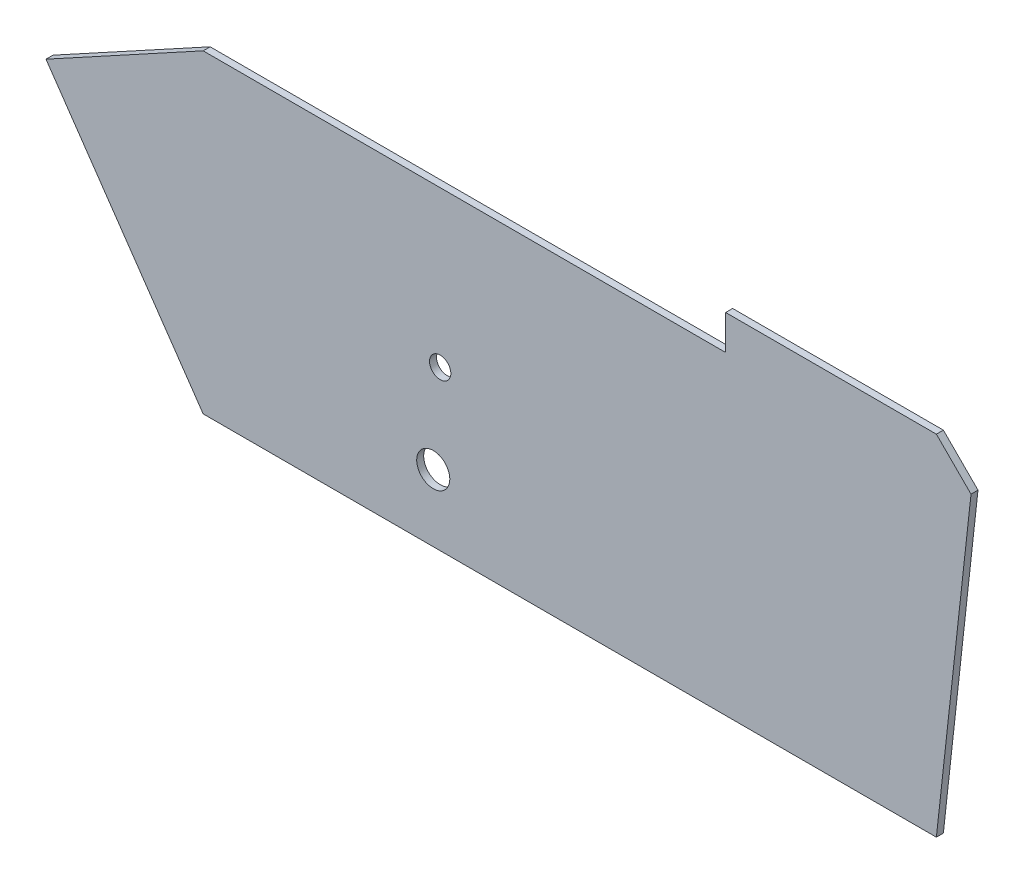
ISO-10303-21;
HEADER;
FILE_DESCRIPTION(('STEP AP214'),'2;1');
FILE_NAME('part.step','',(''),(''),'','','');
FILE_SCHEMA(('AUTOMOTIVE_DESIGN { 1 0 10303 214 1 1 1 1 }'));
ENDSEC;
DATA;
#1=APPLICATION_CONTEXT('core data for automotive mechanical design processes');
#2=APPLICATION_PROTOCOL_DEFINITION('international standard','automotive_design',2000,#1);
#3=PRODUCT_CONTEXT('',#1,'mechanical');
#4=PRODUCT('Part','Part','',(#3));
#5=PRODUCT_RELATED_PRODUCT_CATEGORY('part','',(#4));
#6=PRODUCT_DEFINITION_FORMATION('','',#4);
#7=PRODUCT_DEFINITION_CONTEXT('part definition',#1,'design');
#8=PRODUCT_DEFINITION('design','',#6,#7);
#9=PRODUCT_DEFINITION_SHAPE('','',#8);
#10=(LENGTH_UNIT() NAMED_UNIT(*) SI_UNIT(.MILLI.,.METRE.));
#11=(NAMED_UNIT(*) PLANE_ANGLE_UNIT() SI_UNIT($,.RADIAN.));
#12=(NAMED_UNIT(*) SI_UNIT($,.STERADIAN.) SOLID_ANGLE_UNIT());
#13=UNCERTAINTY_MEASURE_WITH_UNIT(LENGTH_MEASURE(1.E-05),#10,'distance_accuracy_value','');
#14=(GEOMETRIC_REPRESENTATION_CONTEXT(3) GLOBAL_UNCERTAINTY_ASSIGNED_CONTEXT((#13)) GLOBAL_UNIT_ASSIGNED_CONTEXT((#10,
#11,#12)) REPRESENTATION_CONTEXT('',''));
#15=CARTESIAN_POINT('',(0.,0.,0.));
#16=DIRECTION('',(0.,0.,1.));
#17=DIRECTION('',(1.,0.,0.));
#18=AXIS2_PLACEMENT_3D('',#15,#16,#17);
#19=CARTESIAN_POINT('',(131.671208139632,88.9838337182448,2.));
#20=DIRECTION('',(0.,-1.,0.));
#21=DIRECTION('',(0.,0.,-1.));
#22=AXIS2_PLACEMENT_3D('',#19,#20,#21);
#23=PLANE('',#22);
#24=DIRECTION('',(-1.,0.,0.));
#25=VECTOR('',#24,1.);
#26=CARTESIAN_POINT('',(131.671208139632,88.9838337182448,0.));
#27=LINE('',#26,#25);
#28=CARTESIAN_POINT('',(192.039285274391,88.9838337182448,0.));
#29=VERTEX_POINT('',#28);
#30=CARTESIAN_POINT('',(131.671208139632,88.9838337182448,0.));
#31=VERTEX_POINT('',#30);
#32=EDGE_CURVE('E147',#29,#31,#27,.T.);
#33=ORIENTED_EDGE('',*,*,#32,.T.);
#34=DIRECTION('',(0.,0.,-1.));
#35=VECTOR('',#34,1.);
#36=CARTESIAN_POINT('',(131.671208139632,88.9838337182448,2.));
#37=LINE('',#36,#35);
#38=CARTESIAN_POINT('',(131.671208139632,88.9838337182448,2.));
#39=VERTEX_POINT('',#38);
#40=EDGE_CURVE('E11',#39,#31,#37,.T.);
#41=ORIENTED_EDGE('',*,*,#40,.F.);
#42=DIRECTION('',(-1.,0.,0.));
#43=VECTOR('',#42,1.);
#44=CARTESIAN_POINT('',(131.671208139632,88.9838337182448,2.));
#45=LINE('',#44,#43);
#46=CARTESIAN_POINT('',(192.039285274391,88.9838337182448,2.));
#47=VERTEX_POINT('',#46);
#48=EDGE_CURVE('E168',#47,#39,#45,.T.);
#49=ORIENTED_EDGE('',*,*,#48,.F.);
#50=DIRECTION('',(0.,0.,-1.));
#51=VECTOR('',#50,1.);
#52=CARTESIAN_POINT('',(192.039285274391,88.9838337182448,2.));
#53=LINE('',#52,#51);
#54=EDGE_CURVE('E143',#47,#29,#53,.T.);
#55=ORIENTED_EDGE('',*,*,#54,.T.);
#56=EDGE_LOOP('',(#33,#41,#49,#55));
#57=FACE_BOUND('',#56,.T.);
#58=ADVANCED_FACE('F42',(#57),#23,.F.);
#59=CARTESIAN_POINT('',(131.671208139632,79.0600704937911,2.));
#60=DIRECTION('',(1.,0.,0.));
#61=DIRECTION('',(0.,1.,0.));
#62=AXIS2_PLACEMENT_3D('',#59,#60,#61);
#63=PLANE('',#62);
#64=DIRECTION('',(0.,-1.,0.));
#65=VECTOR('',#64,1.);
#66=CARTESIAN_POINT('',(131.671208139632,79.0600704937911,0.));
#67=LINE('',#66,#65);
#68=CARTESIAN_POINT('',(131.671208139632,79.0600704937911,0.));
#69=VERTEX_POINT('',#68);
#70=EDGE_CURVE('E151',#31,#69,#67,.T.);
#71=ORIENTED_EDGE('',*,*,#70,.T.);
#72=DIRECTION('',(0.,0.,-1.));
#73=VECTOR('',#72,1.);
#74=CARTESIAN_POINT('',(131.671208139632,79.0600704937911,2.));
#75=LINE('',#74,#73);
#76=CARTESIAN_POINT('',(131.671208139632,79.0600704937911,2.));
#77=VERTEX_POINT('',#76);
#78=EDGE_CURVE('E52',#77,#69,#75,.T.);
#79=ORIENTED_EDGE('',*,*,#78,.F.);
#80=DIRECTION('',(0.,-1.,0.));
#81=VECTOR('',#80,1.);
#82=CARTESIAN_POINT('',(131.671208139632,79.0600704937911,2.));
#83=LINE('',#82,#81);
#84=EDGE_CURVE('E104',#39,#77,#83,.T.);
#85=ORIENTED_EDGE('',*,*,#84,.F.);
#86=ORIENTED_EDGE('',*,*,#40,.T.);
#87=EDGE_LOOP('',(#71,#79,#85,#86));
#88=FACE_BOUND('',#87,.T.);
#89=ADVANCED_FACE('F241',(#88),#63,.F.);
#90=CARTESIAN_POINT('',(-18.0080374773618,79.0600704937911,2.));
#91=DIRECTION('',(0.,-1.,0.));
#92=DIRECTION('',(0.,0.,-1.));
#93=AXIS2_PLACEMENT_3D('',#90,#91,#92);
#94=PLANE('',#93);
#95=DIRECTION('',(-1.,0.,0.));
#96=VECTOR('',#95,1.);
#97=CARTESIAN_POINT('',(-18.0080374773618,79.0600704937911,0.));
#98=LINE('',#97,#96);
#99=CARTESIAN_POINT('',(-18.0080374773618,79.0600704937911,0.));
#100=VERTEX_POINT('',#99);
#101=EDGE_CURVE('E154',#69,#100,#98,.T.);
#102=ORIENTED_EDGE('',*,*,#101,.T.);
#103=DIRECTION('',(0.,0.,-1.));
#104=VECTOR('',#103,1.);
#105=CARTESIAN_POINT('',(-18.0080374773618,79.0600704937911,2.));
#106=LINE('',#105,#104);
#107=CARTESIAN_POINT('',(-18.0080374773618,79.0600704937911,2.));
#108=VERTEX_POINT('',#107);
#109=EDGE_CURVE('E179',#108,#100,#106,.T.);
#110=ORIENTED_EDGE('',*,*,#109,.F.);
#111=DIRECTION('',(-1.,0.,0.));
#112=VECTOR('',#111,1.);
#113=CARTESIAN_POINT('',(-18.0080374773618,79.0600704937911,2.));
#114=LINE('',#113,#112);
#115=EDGE_CURVE('E206',#77,#108,#114,.T.);
#116=ORIENTED_EDGE('',*,*,#115,.F.);
#117=ORIENTED_EDGE('',*,*,#78,.T.);
#118=EDGE_LOOP('',(#102,#110,#116,#117));
#119=FACE_BOUND('',#118,.T.);
#120=ADVANCED_FACE('F245',(#119),#94,.F.);
#121=CARTESIAN_POINT('',(-18.0080374773618,79.0600704937911,2.));
#122=DIRECTION('',(0.479246327767747,-0.877680441459834,0.));
#123=DIRECTION('',(0.877680441459834,0.479246327767746,0.));
#124=AXIS2_PLACEMENT_3D('',#121,#122,#123);
#125=PLANE('',#124);
#126=DIRECTION('',(-0.877680441459834,-0.479246327767747,0.));
#127=VECTOR('',#126,1.);
#128=CARTESIAN_POINT('',(-18.0080374773618,79.0600704937911,0.));
#129=LINE('',#128,#127);
#130=CARTESIAN_POINT('',(-63.0369515011548,54.4726003054629,0.));
#131=VERTEX_POINT('',#130);
#132=EDGE_CURVE('E157',#100,#131,#129,.T.);
#133=ORIENTED_EDGE('',*,*,#132,.T.);
#134=DIRECTION('',(0.,0.,-1.));
#135=VECTOR('',#134,1.);
#136=CARTESIAN_POINT('',(-63.0369515011548,54.4726003054629,2.));
#137=LINE('',#136,#135);
#138=CARTESIAN_POINT('',(-63.0369515011548,54.4726003054629,2.));
#139=VERTEX_POINT('',#138);
#140=EDGE_CURVE('E175',#139,#131,#137,.T.);
#141=ORIENTED_EDGE('',*,*,#140,.F.);
#142=DIRECTION('',(-0.877680441459834,-0.479246327767747,0.));
#143=VECTOR('',#142,1.);
#144=CARTESIAN_POINT('',(-18.0080374773618,79.0600704937911,2.));
#145=LINE('',#144,#143);
#146=EDGE_CURVE('E209',#108,#139,#145,.T.);
#147=ORIENTED_EDGE('',*,*,#146,.F.);
#148=ORIENTED_EDGE('',*,*,#109,.T.);
#149=EDGE_LOOP('',(#133,#141,#147,#148));
#150=FACE_BOUND('',#149,.T.);
#151=ADVANCED_FACE('F217',(#150),#125,.F.);
#152=CARTESIAN_POINT('',(-63.0369515011548,54.4726003054629,2.));
#153=DIRECTION('',(0.824010279472138,0.566574848827804,0.));
#154=DIRECTION('',(-0.566574848827804,0.824010279472138,0.));
#155=AXIS2_PLACEMENT_3D('',#152,#153,#154);
#156=PLANE('',#155);
#157=DIRECTION('',(0.566574848827804,-0.824010279472138,0.));
#158=VECTOR('',#157,1.);
#159=CARTESIAN_POINT('',(-63.0369515011548,54.4726003054629,0.));
#160=LINE('',#159,#158);
#161=CARTESIAN_POINT('',(-18.0080374773618,-11.0161662817552,0.));
#162=VERTEX_POINT('',#161);
#163=EDGE_CURVE('E160',#131,#162,#160,.T.);
#164=ORIENTED_EDGE('',*,*,#163,.T.);
#165=DIRECTION('',(0.,0.,-1.));
#166=VECTOR('',#165,1.);
#167=CARTESIAN_POINT('',(-18.0080374773618,-11.0161662817552,2.));
#168=LINE('',#167,#166);
#169=CARTESIAN_POINT('',(-18.0080374773618,-11.0161662817552,2.));
#170=VERTEX_POINT('',#169);
#171=EDGE_CURVE('E134',#170,#162,#168,.T.);
#172=ORIENTED_EDGE('',*,*,#171,.F.);
#173=DIRECTION('',(0.566574848827804,-0.824010279472138,0.));
#174=VECTOR('',#173,1.);
#175=CARTESIAN_POINT('',(-63.0369515011548,54.4726003054629,2.));
#176=LINE('',#175,#174);
#177=EDGE_CURVE('E123',#139,#170,#176,.T.);
#178=ORIENTED_EDGE('',*,*,#177,.F.);
#179=ORIENTED_EDGE('',*,*,#140,.T.);
#180=EDGE_LOOP('',(#164,#172,#178,#179));
#181=FACE_BOUND('',#180,.T.);
#182=ADVANCED_FACE('F221',(#181),#156,.F.);
#183=CARTESIAN_POINT('',(192.039285274391,-11.0161662817552,2.));
#184=DIRECTION('',(0.,1.,0.));
#185=DIRECTION('',(0.,0.,1.));
#186=AXIS2_PLACEMENT_3D('',#183,#184,#185);
#187=PLANE('',#186);
#188=DIRECTION('',(1.,0.,0.));
#189=VECTOR('',#188,1.);
#190=CARTESIAN_POINT('',(192.039285274391,-11.0161662817552,0.));
#191=LINE('',#190,#189);
#192=CARTESIAN_POINT('',(192.039285274391,-11.0161662817552,0.));
#193=VERTEX_POINT('',#192);
#194=EDGE_CURVE('E132',#162,#193,#191,.T.);
#195=ORIENTED_EDGE('',*,*,#194,.T.);
#196=DIRECTION('',(0.,0.,-1.));
#197=VECTOR('',#196,1.);
#198=CARTESIAN_POINT('',(192.039285274391,-11.0161662817552,2.));
#199=LINE('',#198,#197);
#200=CARTESIAN_POINT('',(192.039285274391,-11.0161662817552,2.));
#201=VERTEX_POINT('',#200);
#202=EDGE_CURVE('E129',#201,#193,#199,.T.);
#203=ORIENTED_EDGE('',*,*,#202,.F.);
#204=DIRECTION('',(1.,0.,0.));
#205=VECTOR('',#204,1.);
#206=CARTESIAN_POINT('',(192.039285274391,-11.0161662817552,2.));
#207=LINE('',#206,#205);
#208=EDGE_CURVE('E117',#170,#201,#207,.T.);
#209=ORIENTED_EDGE('',*,*,#208,.F.);
#210=ORIENTED_EDGE('',*,*,#171,.T.);
#211=EDGE_LOOP('',(#195,#203,#209,#210));
#212=FACE_BOUND('',#211,.T.);
#213=ADVANCED_FACE('F130',(#212),#187,.F.);
#214=CARTESIAN_POINT('',(201.963048498845,79.0600704937911,2.));
#215=DIRECTION('',(-0.993985899460386,0.109508135195194,0.));
#216=DIRECTION('',(-0.109508135195194,-0.993985899460385,0.));
#217=AXIS2_PLACEMENT_3D('',#214,#215,#216);
#218=PLANE('',#217);
#219=DIRECTION('',(0.109508135195194,0.993985899460385,0.));
#220=VECTOR('',#219,1.);
#221=CARTESIAN_POINT('',(201.963048498845,79.0600704937911,0.));
#222=LINE('',#221,#220);
#223=CARTESIAN_POINT('',(201.963048498845,79.0600704937911,0.));
#224=VERTEX_POINT('',#223);
#225=EDGE_CURVE('E90',#193,#224,#222,.T.);
#226=ORIENTED_EDGE('',*,*,#225,.T.);
#227=DIRECTION('',(0.,0.,-1.));
#228=VECTOR('',#227,1.);
#229=CARTESIAN_POINT('',(201.963048498845,79.0600704937911,2.));
#230=LINE('',#229,#228);
#231=CARTESIAN_POINT('',(201.963048498845,79.0600704937911,2.));
#232=VERTEX_POINT('',#231);
#233=EDGE_CURVE('E135',#232,#224,#230,.T.);
#234=ORIENTED_EDGE('',*,*,#233,.F.);
#235=DIRECTION('',(0.109508135195194,0.993985899460385,0.));
#236=VECTOR('',#235,1.);
#237=CARTESIAN_POINT('',(201.963048498845,79.0600704937911,2.));
#238=LINE('',#237,#236);
#239=EDGE_CURVE('E121',#201,#232,#238,.T.);
#240=ORIENTED_EDGE('',*,*,#239,.F.);
#241=ORIENTED_EDGE('',*,*,#202,.T.);
#242=EDGE_LOOP('',(#226,#234,#240,#241));
#243=FACE_BOUND('',#242,.T.);
#244=ADVANCED_FACE('F137',(#243),#218,.F.);
#245=CARTESIAN_POINT('',(192.039285274391,88.9838337182448,2.));
#246=DIRECTION('',(-0.707106781186538,-0.707106781186557,0.));
#247=DIRECTION('',(0.707106781186557,-0.707106781186538,0.));
#248=AXIS2_PLACEMENT_3D('',#245,#246,#247);
#249=PLANE('',#248);
#250=DIRECTION('',(-0.707106781186557,0.707106781186538,0.));
#251=VECTOR('',#250,1.);
#252=CARTESIAN_POINT('',(192.039285274391,88.9838337182448,0.));
#253=LINE('',#252,#251);
#254=EDGE_CURVE('E96',#224,#29,#253,.T.);
#255=ORIENTED_EDGE('',*,*,#254,.T.);
#256=ORIENTED_EDGE('',*,*,#54,.F.);
#257=DIRECTION('',(-0.707106781186557,0.707106781186538,0.));
#258=VECTOR('',#257,1.);
#259=CARTESIAN_POINT('',(192.039285274391,88.9838337182448,2.));
#260=LINE('',#259,#258);
#261=EDGE_CURVE('E61',#232,#47,#260,.T.);
#262=ORIENTED_EDGE('',*,*,#261,.F.);
#263=ORIENTED_EDGE('',*,*,#233,.T.);
#264=EDGE_LOOP('',(#255,#256,#262,#263));
#265=FACE_BOUND('',#264,.T.);
#266=ADVANCED_FACE('F229',(#265),#249,.F.);
#267=CARTESIAN_POINT('',(0.,0.,2.));
#268=DIRECTION('',(0.,0.,1.));
#269=DIRECTION('',(1.,0.,0.));
#270=AXIS2_PLACEMENT_3D('',#267,#268,#269);
#271=PLANE('',#270);
#272=CARTESIAN_POINT('',(49.8866779353484,34.4675522702589,2.));
#273=DIRECTION('',(0.,0.,1.));
#274=DIRECTION('',(1.,0.,0.));
#275=AXIS2_PLACEMENT_3D('',#272,#273,#274);
#276=CIRCLE('',#275,3.05);
#277=CARTESIAN_POINT('',(52.9366779353484,34.4675522702589,2.));
#278=VERTEX_POINT('',#277);
#279=EDGE_CURVE('E187',#278,#278,#276,.T.);
#280=ORIENTED_EDGE('',*,*,#279,.F.);
#281=EDGE_LOOP('',(#280));
#282=FACE_BOUND('',#281,.T.);
#283=CARTESIAN_POINT('',(47.9036958266471,8.11958427377336,2.));
#284=DIRECTION('',(0.,0.,1.));
#285=DIRECTION('',(1.,0.,0.));
#286=AXIS2_PLACEMENT_3D('',#283,#284,#285);
#287=CIRCLE('',#286,4.74041763313524);
#288=CARTESIAN_POINT('',(52.6441134597823,8.11958427377336,2.));
#289=VERTEX_POINT('',#288);
#290=EDGE_CURVE('E194',#289,#289,#287,.T.);
#291=ORIENTED_EDGE('',*,*,#290,.F.);
#292=EDGE_LOOP('',(#291));
#293=FACE_BOUND('',#292,.T.);
#294=ORIENTED_EDGE('',*,*,#48,.T.);
#295=ORIENTED_EDGE('',*,*,#84,.T.);
#296=ORIENTED_EDGE('',*,*,#115,.T.);
#297=ORIENTED_EDGE('',*,*,#146,.T.);
#298=ORIENTED_EDGE('',*,*,#177,.T.);
#299=ORIENTED_EDGE('',*,*,#208,.T.);
#300=ORIENTED_EDGE('',*,*,#239,.T.);
#301=ORIENTED_EDGE('',*,*,#261,.T.);
#302=EDGE_LOOP('',(#294,#295,#296,#297,#298,#299,#300,#301));
#303=FACE_BOUND('',#302,.T.);
#304=ADVANCED_FACE('F119',(#282,#293,#303),#271,.T.);
#305=CARTESIAN_POINT('',(0.,0.,0.));
#306=DIRECTION('',(0.,0.,1.));
#307=DIRECTION('',(1.,0.,0.));
#308=AXIS2_PLACEMENT_3D('',#305,#306,#307);
#309=PLANE('',#308);
#310=CARTESIAN_POINT('',(49.8866779353484,34.4675522702589,0.));
#311=DIRECTION('',(0.,0.,1.));
#312=DIRECTION('',(1.,0.,0.));
#313=AXIS2_PLACEMENT_3D('',#310,#311,#312);
#314=CIRCLE('',#313,3.05);
#315=CARTESIAN_POINT('',(52.9366779353484,34.4675522702589,0.));
#316=VERTEX_POINT('',#315);
#317=EDGE_CURVE('E45',#316,#316,#314,.T.);
#318=ORIENTED_EDGE('',*,*,#317,.T.);
#319=EDGE_LOOP('',(#318));
#320=FACE_BOUND('',#319,.T.);
#321=CARTESIAN_POINT('',(47.9036958266471,8.11958427377336,0.));
#322=DIRECTION('',(0.,0.,1.));
#323=DIRECTION('',(1.,0.,0.));
#324=AXIS2_PLACEMENT_3D('',#321,#322,#323);
#325=CIRCLE('',#324,4.74041763313524);
#326=CARTESIAN_POINT('',(52.6441134597823,8.11958427377336,0.));
#327=VERTEX_POINT('',#326);
#328=EDGE_CURVE('E185',#327,#327,#325,.T.);
#329=ORIENTED_EDGE('',*,*,#328,.T.);
#330=EDGE_LOOP('',(#329));
#331=FACE_BOUND('',#330,.T.);
#332=ORIENTED_EDGE('',*,*,#32,.F.);
#333=ORIENTED_EDGE('',*,*,#254,.F.);
#334=ORIENTED_EDGE('',*,*,#225,.F.);
#335=ORIENTED_EDGE('',*,*,#194,.F.);
#336=ORIENTED_EDGE('',*,*,#163,.F.);
#337=ORIENTED_EDGE('',*,*,#132,.F.);
#338=ORIENTED_EDGE('',*,*,#101,.F.);
#339=ORIENTED_EDGE('',*,*,#70,.F.);
#340=EDGE_LOOP('',(#332,#333,#334,#335,#336,#337,#338,#339));
#341=FACE_BOUND('',#340,.T.);
#342=ADVANCED_FACE('F224',(#320,#331,#341),#309,.F.);
#343=CARTESIAN_POINT('',(47.9036958266471,8.11958427377336,-8.));
#344=DIRECTION('',(0.,0.,1.));
#345=DIRECTION('',(1.,0.,0.));
#346=AXIS2_PLACEMENT_3D('',#343,#344,#345);
#347=CYLINDRICAL_SURFACE('',#346,4.74041763313524);
#348=ORIENTED_EDGE('',*,*,#290,.T.);
#349=EDGE_LOOP('',(#348));
#350=FACE_BOUND('',#349,.T.);
#351=ORIENTED_EDGE('',*,*,#328,.F.);
#352=EDGE_LOOP('',(#351));
#353=FACE_BOUND('',#352,.T.);
#354=ADVANCED_FACE('F279',(#350,#353),#347,.F.);
#355=CARTESIAN_POINT('',(49.8866779353484,34.4675522702589,-8.));
#356=DIRECTION('',(0.,0.,1.));
#357=DIRECTION('',(1.,0.,0.));
#358=AXIS2_PLACEMENT_3D('',#355,#356,#357);
#359=CYLINDRICAL_SURFACE('',#358,3.05);
#360=ORIENTED_EDGE('',*,*,#279,.T.);
#361=EDGE_LOOP('',(#360));
#362=FACE_BOUND('',#361,.T.);
#363=ORIENTED_EDGE('',*,*,#317,.F.);
#364=EDGE_LOOP('',(#363));
#365=FACE_BOUND('',#364,.T.);
#366=ADVANCED_FACE('F287',(#362,#365),#359,.F.);
#367=CLOSED_SHELL('',(#58,#89,#120,#151,#182,#213,#244,#266,#304,#342,#354,#366));
#368=MANIFOLD_SOLID_BREP('B2',#367);
#369=ADVANCED_BREP_SHAPE_REPRESENTATION('',(#18,#368),#14);
#370=SHAPE_DEFINITION_REPRESENTATION(#9,#369);
ENDSEC;
END-ISO-10303-21;
